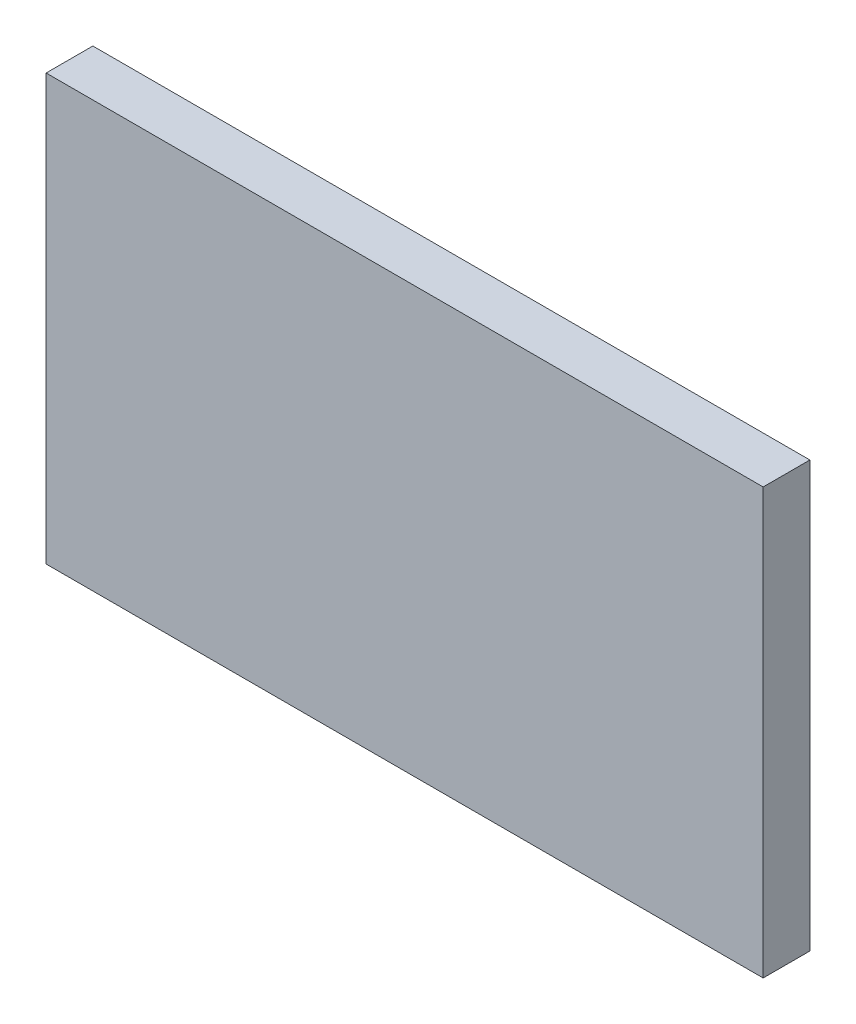
ISO-10303-21;
HEADER;
FILE_DESCRIPTION(('STEP AP214'),'2;1');
FILE_NAME('part.step','',(''),(''),'','','');
FILE_SCHEMA(('AUTOMOTIVE_DESIGN { 1 0 10303 214 1 1 1 1 }'));
ENDSEC;
DATA;
#1=APPLICATION_CONTEXT('core data for automotive mechanical design processes');
#2=APPLICATION_PROTOCOL_DEFINITION('international standard','automotive_design',2000,#1);
#3=PRODUCT_CONTEXT('',#1,'mechanical');
#4=PRODUCT('Part','Part','',(#3));
#5=PRODUCT_RELATED_PRODUCT_CATEGORY('part','',(#4));
#6=PRODUCT_DEFINITION_FORMATION('','',#4);
#7=PRODUCT_DEFINITION_CONTEXT('part definition',#1,'design');
#8=PRODUCT_DEFINITION('design','',#6,#7);
#9=PRODUCT_DEFINITION_SHAPE('','',#8);
#10=(LENGTH_UNIT() NAMED_UNIT(*) SI_UNIT(.MILLI.,.METRE.));
#11=(NAMED_UNIT(*) PLANE_ANGLE_UNIT() SI_UNIT($,.RADIAN.));
#12=(NAMED_UNIT(*) SI_UNIT($,.STERADIAN.) SOLID_ANGLE_UNIT());
#13=UNCERTAINTY_MEASURE_WITH_UNIT(LENGTH_MEASURE(1.E-05),#10,'distance_accuracy_value','');
#14=(GEOMETRIC_REPRESENTATION_CONTEXT(3) GLOBAL_UNCERTAINTY_ASSIGNED_CONTEXT((#13)) GLOBAL_UNIT_ASSIGNED_CONTEXT((#10,
#11,#12)) REPRESENTATION_CONTEXT('',''));
#15=CARTESIAN_POINT('',(0.,0.,0.));
#16=DIRECTION('',(0.,0.,1.));
#17=DIRECTION('',(1.,0.,0.));
#18=AXIS2_PLACEMENT_3D('',#15,#16,#17);
#19=CARTESIAN_POINT('',(-222.995661641974,-9.49999999999998,-5.));
#20=DIRECTION('',(0.,-1.,0.));
#21=DIRECTION('',(1.,0.,0.));
#22=AXIS2_PLACEMENT_3D('',#19,#20,#21);
#23=PLANE('',#22);
#24=DIRECTION('',(1.,0.,0.));
#25=VECTOR('',#24,1.);
#26=CARTESIAN_POINT('',(-222.995661641974,-9.49999999999998,0.));
#27=LINE('',#26,#25);
#28=CARTESIAN_POINT('',(-222.995661641974,-9.49999999999998,0.));
#29=VERTEX_POINT('',#28);
#30=CARTESIAN_POINT('',(-146.2775,-9.49999999999999,0.));
#31=VERTEX_POINT('',#30);
#32=EDGE_CURVE('E98',#29,#31,#27,.T.);
#33=ORIENTED_EDGE('',*,*,#32,.T.);
#34=DIRECTION('',(0.,0.,1.));
#35=VECTOR('',#34,1.);
#36=CARTESIAN_POINT('',(-146.2775,-9.49999999999999,-5.));
#37=LINE('',#36,#35);
#38=CARTESIAN_POINT('',(-146.2775,-9.49999999999999,-5.));
#39=VERTEX_POINT('',#38);
#40=EDGE_CURVE('E11',#39,#31,#37,.T.);
#41=ORIENTED_EDGE('',*,*,#40,.F.);
#42=DIRECTION('',(1.,0.,0.));
#43=VECTOR('',#42,1.);
#44=CARTESIAN_POINT('',(-222.995661641974,-9.49999999999998,-5.));
#45=LINE('',#44,#43);
#46=CARTESIAN_POINT('',(-222.995661641974,-9.49999999999998,-5.));
#47=VERTEX_POINT('',#46);
#48=EDGE_CURVE('E86',#47,#39,#45,.T.);
#49=ORIENTED_EDGE('',*,*,#48,.F.);
#50=DIRECTION('',(0.,0.,1.));
#51=VECTOR('',#50,1.);
#52=CARTESIAN_POINT('',(-222.995661641974,-9.49999999999998,-5.));
#53=LINE('',#52,#51);
#54=EDGE_CURVE('E94',#47,#29,#53,.T.);
#55=ORIENTED_EDGE('',*,*,#54,.T.);
#56=EDGE_LOOP('',(#33,#41,#49,#55));
#57=FACE_BOUND('',#56,.T.);
#58=ADVANCED_FACE('F35',(#57),#23,.F.);
#59=CARTESIAN_POINT('',(-146.2775,-9.49999999999999,-5.));
#60=DIRECTION('',(-1.,0.,0.));
#61=DIRECTION('',(0.,0.,1.));
#62=AXIS2_PLACEMENT_3D('',#59,#60,#61);
#63=PLANE('',#62);
#64=DIRECTION('',(0.,-1.,0.));
#65=VECTOR('',#64,1.);
#66=CARTESIAN_POINT('',(-146.2775,-9.49999999999999,0.));
#67=LINE('',#66,#65);
#68=CARTESIAN_POINT('',(-146.2775,-55.,0.));
#69=VERTEX_POINT('',#68);
#70=EDGE_CURVE('E90',#31,#69,#67,.T.);
#71=ORIENTED_EDGE('',*,*,#70,.T.);
#72=DIRECTION('',(0.,0.,1.));
#73=VECTOR('',#72,1.);
#74=CARTESIAN_POINT('',(-146.2775,-55.,-5.));
#75=LINE('',#74,#73);
#76=CARTESIAN_POINT('',(-146.2775,-55.,-5.));
#77=VERTEX_POINT('',#76);
#78=EDGE_CURVE('E43',#77,#69,#75,.T.);
#79=ORIENTED_EDGE('',*,*,#78,.F.);
#80=DIRECTION('',(0.,-1.,0.));
#81=VECTOR('',#80,1.);
#82=CARTESIAN_POINT('',(-146.2775,-9.49999999999999,-5.));
#83=LINE('',#82,#81);
#84=EDGE_CURVE('E81',#39,#77,#83,.T.);
#85=ORIENTED_EDGE('',*,*,#84,.F.);
#86=ORIENTED_EDGE('',*,*,#40,.T.);
#87=EDGE_LOOP('',(#71,#79,#85,#86));
#88=FACE_BOUND('',#87,.T.);
#89=ADVANCED_FACE('F89',(#88),#63,.F.);
#90=CARTESIAN_POINT('',(-222.995661641974,-55.,-5.));
#91=DIRECTION('',(0.,1.,0.));
#92=DIRECTION('',(-1.,0.,0.));
#93=AXIS2_PLACEMENT_3D('',#90,#91,#92);
#94=PLANE('',#93);
#95=DIRECTION('',(-1.,0.,0.));
#96=VECTOR('',#95,1.);
#97=CARTESIAN_POINT('',(-222.995661641974,-55.,0.));
#98=LINE('',#97,#96);
#99=CARTESIAN_POINT('',(-222.995661641974,-55.,0.));
#100=VERTEX_POINT('',#99);
#101=EDGE_CURVE('E68',#69,#100,#98,.T.);
#102=ORIENTED_EDGE('',*,*,#101,.T.);
#103=DIRECTION('',(0.,0.,1.));
#104=VECTOR('',#103,1.);
#105=CARTESIAN_POINT('',(-222.995661641974,-55.,-5.));
#106=LINE('',#105,#104);
#107=CARTESIAN_POINT('',(-222.995661641974,-55.,-5.));
#108=VERTEX_POINT('',#107);
#109=EDGE_CURVE('E91',#108,#100,#106,.T.);
#110=ORIENTED_EDGE('',*,*,#109,.F.);
#111=DIRECTION('',(-1.,0.,0.));
#112=VECTOR('',#111,1.);
#113=CARTESIAN_POINT('',(-222.995661641974,-55.,-5.));
#114=LINE('',#113,#112);
#115=EDGE_CURVE('E84',#77,#108,#114,.T.);
#116=ORIENTED_EDGE('',*,*,#115,.F.);
#117=ORIENTED_EDGE('',*,*,#78,.T.);
#118=EDGE_LOOP('',(#102,#110,#116,#117));
#119=FACE_BOUND('',#118,.T.);
#120=ADVANCED_FACE('F92',(#119),#94,.F.);
#121=CARTESIAN_POINT('',(-222.995661641974,-9.49999999999998,-5.));
#122=DIRECTION('',(1.,0.,0.));
#123=DIRECTION('',(0.,1.,0.));
#124=AXIS2_PLACEMENT_3D('',#121,#122,#123);
#125=PLANE('',#124);
#126=DIRECTION('',(0.,1.,0.));
#127=VECTOR('',#126,1.);
#128=CARTESIAN_POINT('',(-222.995661641974,-9.49999999999998,0.));
#129=LINE('',#128,#127);
#130=EDGE_CURVE('E74',#100,#29,#129,.T.);
#131=ORIENTED_EDGE('',*,*,#130,.T.);
#132=ORIENTED_EDGE('',*,*,#54,.F.);
#133=DIRECTION('',(0.,1.,0.));
#134=VECTOR('',#133,1.);
#135=CARTESIAN_POINT('',(-222.995661641974,-9.49999999999998,-5.));
#136=LINE('',#135,#134);
#137=EDGE_CURVE('E51',#108,#47,#136,.T.);
#138=ORIENTED_EDGE('',*,*,#137,.F.);
#139=ORIENTED_EDGE('',*,*,#109,.T.);
#140=EDGE_LOOP('',(#131,#132,#138,#139));
#141=FACE_BOUND('',#140,.T.);
#142=ADVANCED_FACE('F105',(#141),#125,.F.);
#143=CARTESIAN_POINT('',(0.,0.,-5.));
#144=DIRECTION('',(0.,0.,-1.));
#145=DIRECTION('',(-1.,0.,0.));
#146=AXIS2_PLACEMENT_3D('',#143,#144,#145);
#147=PLANE('',#146);
#148=ORIENTED_EDGE('',*,*,#48,.T.);
#149=ORIENTED_EDGE('',*,*,#84,.T.);
#150=ORIENTED_EDGE('',*,*,#115,.T.);
#151=ORIENTED_EDGE('',*,*,#137,.T.);
#152=EDGE_LOOP('',(#148,#149,#150,#151));
#153=FACE_BOUND('',#152,.T.);
#154=ADVANCED_FACE('F82',(#153),#147,.T.);
#155=CARTESIAN_POINT('',(0.,0.,0.));
#156=DIRECTION('',(0.,0.,-1.));
#157=DIRECTION('',(-1.,0.,0.));
#158=AXIS2_PLACEMENT_3D('',#155,#156,#157);
#159=PLANE('',#158);
#160=ORIENTED_EDGE('',*,*,#32,.F.);
#161=ORIENTED_EDGE('',*,*,#130,.F.);
#162=ORIENTED_EDGE('',*,*,#101,.F.);
#163=ORIENTED_EDGE('',*,*,#70,.F.);
#164=EDGE_LOOP('',(#160,#161,#162,#163));
#165=FACE_BOUND('',#164,.T.);
#166=ADVANCED_FACE('F108',(#165),#159,.F.);
#167=CLOSED_SHELL('',(#58,#89,#120,#142,#154,#166));
#168=MANIFOLD_SOLID_BREP('B2',#167);
#169=ADVANCED_BREP_SHAPE_REPRESENTATION('',(#18,#168),#14);
#170=SHAPE_DEFINITION_REPRESENTATION(#9,#169);
ENDSEC;
END-ISO-10303-21;
